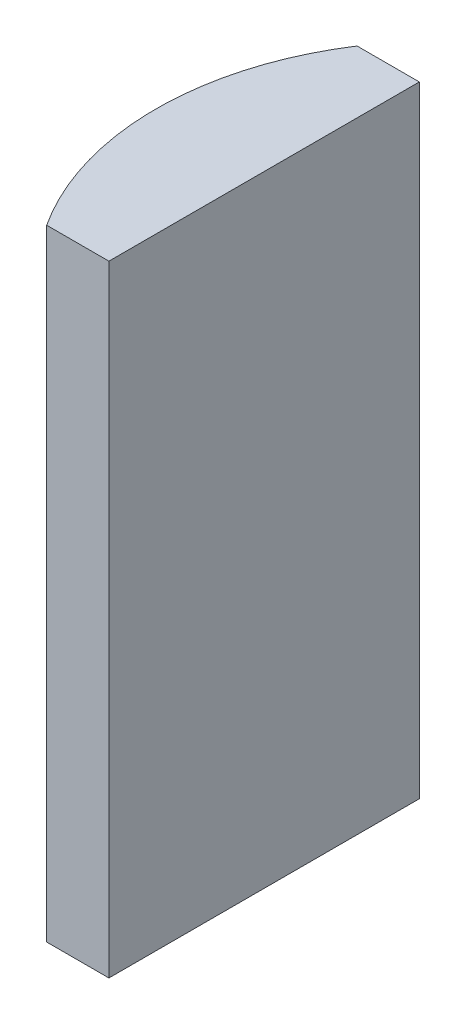
ISO-10303-21;
HEADER;
FILE_DESCRIPTION(('STEP AP214'),'2;1');
FILE_NAME('part.step','',(''),(''),'','','');
FILE_SCHEMA(('AUTOMOTIVE_DESIGN { 1 0 10303 214 1 1 1 1 }'));
ENDSEC;
DATA;
#1=APPLICATION_CONTEXT('core data for automotive mechanical design processes');
#2=APPLICATION_PROTOCOL_DEFINITION('international standard','automotive_design',2000,#1);
#3=PRODUCT_CONTEXT('',#1,'mechanical');
#4=PRODUCT('Part','Part','',(#3));
#5=PRODUCT_RELATED_PRODUCT_CATEGORY('part','',(#4));
#6=PRODUCT_DEFINITION_FORMATION('','',#4);
#7=PRODUCT_DEFINITION_CONTEXT('part definition',#1,'design');
#8=PRODUCT_DEFINITION('design','',#6,#7);
#9=PRODUCT_DEFINITION_SHAPE('','',#8);
#10=(LENGTH_UNIT() NAMED_UNIT(*) SI_UNIT(.MILLI.,.METRE.));
#11=(NAMED_UNIT(*) PLANE_ANGLE_UNIT() SI_UNIT($,.RADIAN.));
#12=(NAMED_UNIT(*) SI_UNIT($,.STERADIAN.) SOLID_ANGLE_UNIT());
#13=UNCERTAINTY_MEASURE_WITH_UNIT(LENGTH_MEASURE(1.E-05),#10,'distance_accuracy_value','');
#14=(GEOMETRIC_REPRESENTATION_CONTEXT(3) GLOBAL_UNCERTAINTY_ASSIGNED_CONTEXT((#13)) GLOBAL_UNIT_ASSIGNED_CONTEXT((#10,
#11,#12)) REPRESENTATION_CONTEXT('',''));
#15=CARTESIAN_POINT('',(0.,0.,0.));
#16=DIRECTION('',(0.,0.,1.));
#17=DIRECTION('',(1.,0.,0.));
#18=AXIS2_PLACEMENT_3D('',#15,#16,#17);
#19=CARTESIAN_POINT('',(4.35520433485127,20.,0.));
#20=DIRECTION('',(0.,-1.,0.));
#21=DIRECTION('',(0.,0.,-1.));
#22=AXIS2_PLACEMENT_3D('',#19,#20,#21);
#23=CYLINDRICAL_SURFACE('',#22,9.16);
#24=CARTESIAN_POINT('',(4.35520433485127,0.,0.));
#25=DIRECTION('',(0.,1.,0.));
#26=DIRECTION('',(0.,0.,1.));
#27=AXIS2_PLACEMENT_3D('',#24,#25,#26);
#28=CIRCLE('',#27,9.16);
#29=CARTESIAN_POINT('',(-3.31979403648407,0.,-5.));
#30=VERTEX_POINT('',#29);
#31=CARTESIAN_POINT('',(-3.31979403648407,0.,5.));
#32=VERTEX_POINT('',#31);
#33=EDGE_CURVE('E100',#30,#32,#28,.T.);
#34=ORIENTED_EDGE('',*,*,#33,.T.);
#35=DIRECTION('',(0.,-1.,0.));
#36=VECTOR('',#35,1.);
#37=CARTESIAN_POINT('',(-3.31979403648407,20.,5.));
#38=LINE('',#37,#36);
#39=CARTESIAN_POINT('',(-3.31979403648407,20.,5.));
#40=VERTEX_POINT('',#39);
#41=EDGE_CURVE('E11',#40,#32,#38,.T.);
#42=ORIENTED_EDGE('',*,*,#41,.F.);
#43=CARTESIAN_POINT('',(4.35520433485127,20.,0.));
#44=DIRECTION('',(0.,1.,0.));
#45=DIRECTION('',(0.,0.,1.));
#46=AXIS2_PLACEMENT_3D('',#43,#44,#45);
#47=CIRCLE('',#46,9.16);
#48=CARTESIAN_POINT('',(-3.31979403648407,20.,-5.));
#49=VERTEX_POINT('',#48);
#50=EDGE_CURVE('E88',#49,#40,#47,.T.);
#51=ORIENTED_EDGE('',*,*,#50,.F.);
#52=DIRECTION('',(0.,-1.,0.));
#53=VECTOR('',#52,1.);
#54=CARTESIAN_POINT('',(-3.31979403648407,20.,-5.));
#55=LINE('',#54,#53);
#56=EDGE_CURVE('E96',#49,#30,#55,.T.);
#57=ORIENTED_EDGE('',*,*,#56,.T.);
#58=EDGE_LOOP('',(#34,#42,#51,#57));
#59=FACE_BOUND('',#58,.T.);
#60=ADVANCED_FACE('F37',(#59),#23,.T.);
#61=CARTESIAN_POINT('',(-3.31979403648407,20.,5.));
#62=DIRECTION('',(0.,0.,-1.));
#63=DIRECTION('',(-1.,0.,0.));
#64=AXIS2_PLACEMENT_3D('',#61,#62,#63);
#65=PLANE('',#64);
#66=DIRECTION('',(1.,0.,0.));
#67=VECTOR('',#66,1.);
#68=CARTESIAN_POINT('',(-3.31979403648407,0.,5.));
#69=LINE('',#68,#67);
#70=CARTESIAN_POINT('',(-1.31479566514873,0.,5.));
#71=VERTEX_POINT('',#70);
#72=EDGE_CURVE('E92',#32,#71,#69,.T.);
#73=ORIENTED_EDGE('',*,*,#72,.T.);
#74=DIRECTION('',(0.,-1.,0.));
#75=VECTOR('',#74,1.);
#76=CARTESIAN_POINT('',(-1.31479566514873,20.,5.));
#77=LINE('',#76,#75);
#78=CARTESIAN_POINT('',(-1.31479566514873,20.,5.));
#79=VERTEX_POINT('',#78);
#80=EDGE_CURVE('E45',#79,#71,#77,.T.);
#81=ORIENTED_EDGE('',*,*,#80,.F.);
#82=DIRECTION('',(1.,0.,0.));
#83=VECTOR('',#82,1.);
#84=CARTESIAN_POINT('',(-3.31979403648407,20.,5.));
#85=LINE('',#84,#83);
#86=EDGE_CURVE('E83',#40,#79,#85,.T.);
#87=ORIENTED_EDGE('',*,*,#86,.F.);
#88=ORIENTED_EDGE('',*,*,#41,.T.);
#89=EDGE_LOOP('',(#73,#81,#87,#88));
#90=FACE_BOUND('',#89,.T.);
#91=ADVANCED_FACE('F91',(#90),#65,.F.);
#92=CARTESIAN_POINT('',(-1.31479566514874,20.,-5.));
#93=DIRECTION('',(-1.,0.,0.));
#94=DIRECTION('',(0.,0.,1.));
#95=AXIS2_PLACEMENT_3D('',#92,#93,#94);
#96=PLANE('',#95);
#97=DIRECTION('',(0.,0.,-1.));
#98=VECTOR('',#97,1.);
#99=CARTESIAN_POINT('',(-1.31479566514874,0.,-5.));
#100=LINE('',#99,#98);
#101=CARTESIAN_POINT('',(-1.31479566514874,0.,-5.));
#102=VERTEX_POINT('',#101);
#103=EDGE_CURVE('E70',#71,#102,#100,.T.);
#104=ORIENTED_EDGE('',*,*,#103,.T.);
#105=DIRECTION('',(0.,-1.,0.));
#106=VECTOR('',#105,1.);
#107=CARTESIAN_POINT('',(-1.31479566514874,20.,-5.));
#108=LINE('',#107,#106);
#109=CARTESIAN_POINT('',(-1.31479566514874,20.,-5.));
#110=VERTEX_POINT('',#109);
#111=EDGE_CURVE('E93',#110,#102,#108,.T.);
#112=ORIENTED_EDGE('',*,*,#111,.F.);
#113=DIRECTION('',(0.,0.,-1.));
#114=VECTOR('',#113,1.);
#115=CARTESIAN_POINT('',(-1.31479566514874,20.,-5.));
#116=LINE('',#115,#114);
#117=EDGE_CURVE('E86',#79,#110,#116,.T.);
#118=ORIENTED_EDGE('',*,*,#117,.F.);
#119=ORIENTED_EDGE('',*,*,#80,.T.);
#120=EDGE_LOOP('',(#104,#112,#118,#119));
#121=FACE_BOUND('',#120,.T.);
#122=ADVANCED_FACE('F94',(#121),#96,.F.);
#123=CARTESIAN_POINT('',(-3.31979403648407,20.,-5.));
#124=DIRECTION('',(0.,0.,1.));
#125=DIRECTION('',(1.,0.,0.));
#126=AXIS2_PLACEMENT_3D('',#123,#124,#125);
#127=PLANE('',#126);
#128=DIRECTION('',(-1.,0.,0.));
#129=VECTOR('',#128,1.);
#130=CARTESIAN_POINT('',(-3.31979403648407,0.,-5.));
#131=LINE('',#130,#129);
#132=EDGE_CURVE('E76',#102,#30,#131,.T.);
#133=ORIENTED_EDGE('',*,*,#132,.T.);
#134=ORIENTED_EDGE('',*,*,#56,.F.);
#135=DIRECTION('',(-1.,0.,0.));
#136=VECTOR('',#135,1.);
#137=CARTESIAN_POINT('',(-3.31979403648407,20.,-5.));
#138=LINE('',#137,#136);
#139=EDGE_CURVE('E53',#110,#49,#138,.T.);
#140=ORIENTED_EDGE('',*,*,#139,.F.);
#141=ORIENTED_EDGE('',*,*,#111,.T.);
#142=EDGE_LOOP('',(#133,#134,#140,#141));
#143=FACE_BOUND('',#142,.T.);
#144=ADVANCED_FACE('F107',(#143),#127,.F.);
#145=CARTESIAN_POINT('',(4.35520433485127,20.,0.));
#146=DIRECTION('',(0.,1.,0.));
#147=DIRECTION('',(0.,0.,1.));
#148=AXIS2_PLACEMENT_3D('',#145,#146,#147);
#149=PLANE('',#148);
#150=ORIENTED_EDGE('',*,*,#50,.T.);
#151=ORIENTED_EDGE('',*,*,#86,.T.);
#152=ORIENTED_EDGE('',*,*,#117,.T.);
#153=ORIENTED_EDGE('',*,*,#139,.T.);
#154=EDGE_LOOP('',(#150,#151,#152,#153));
#155=FACE_BOUND('',#154,.T.);
#156=ADVANCED_FACE('F84',(#155),#149,.T.);
#157=CARTESIAN_POINT('',(4.35520433485127,0.,0.));
#158=DIRECTION('',(0.,1.,0.));
#159=DIRECTION('',(0.,0.,1.));
#160=AXIS2_PLACEMENT_3D('',#157,#158,#159);
#161=PLANE('',#160);
#162=ORIENTED_EDGE('',*,*,#33,.F.);
#163=ORIENTED_EDGE('',*,*,#132,.F.);
#164=ORIENTED_EDGE('',*,*,#103,.F.);
#165=ORIENTED_EDGE('',*,*,#72,.F.);
#166=EDGE_LOOP('',(#162,#163,#164,#165));
#167=FACE_BOUND('',#166,.T.);
#168=ADVANCED_FACE('F110',(#167),#161,.F.);
#169=CLOSED_SHELL('',(#60,#91,#122,#144,#156,#168));
#170=MANIFOLD_SOLID_BREP('B2',#169);
#171=ADVANCED_BREP_SHAPE_REPRESENTATION('',(#18,#170),#14);
#172=SHAPE_DEFINITION_REPRESENTATION(#9,#171);
ENDSEC;
END-ISO-10303-21;
